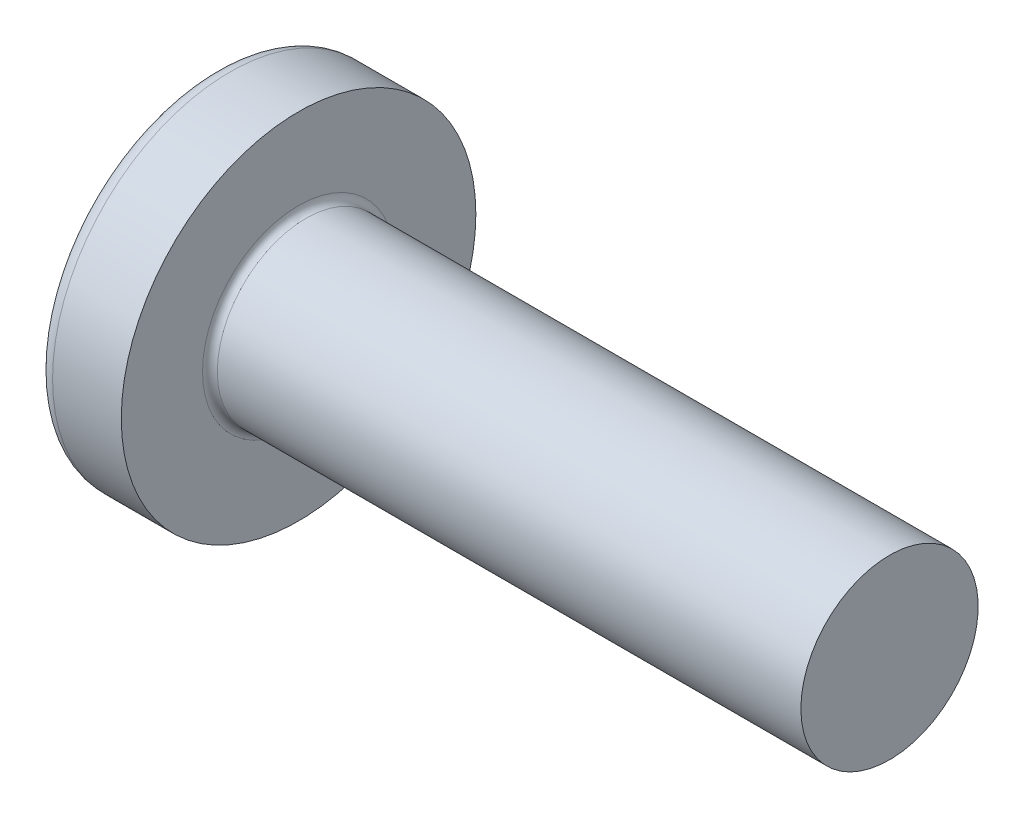
ISO-10303-21;
HEADER;
FILE_DESCRIPTION(('STEP AP214'),'2;1');
FILE_NAME('part.step','',(''),(''),'','','');
FILE_SCHEMA(('AUTOMOTIVE_DESIGN { 1 0 10303 214 1 1 1 1 }'));
ENDSEC;
DATA;
#1=APPLICATION_CONTEXT('core data for automotive mechanical design processes');
#2=APPLICATION_PROTOCOL_DEFINITION('international standard','automotive_design',2000,#1);
#3=PRODUCT_CONTEXT('',#1,'mechanical');
#4=PRODUCT('Part','Part','',(#3));
#5=PRODUCT_RELATED_PRODUCT_CATEGORY('part','',(#4));
#6=PRODUCT_DEFINITION_FORMATION('','',#4);
#7=PRODUCT_DEFINITION_CONTEXT('part definition',#1,'design');
#8=PRODUCT_DEFINITION('design','',#6,#7);
#9=PRODUCT_DEFINITION_SHAPE('','',#8);
#10=(LENGTH_UNIT() NAMED_UNIT(*) SI_UNIT(.MILLI.,.METRE.));
#11=(NAMED_UNIT(*) PLANE_ANGLE_UNIT() SI_UNIT($,.RADIAN.));
#12=(NAMED_UNIT(*) SI_UNIT($,.STERADIAN.) SOLID_ANGLE_UNIT());
#13=UNCERTAINTY_MEASURE_WITH_UNIT(LENGTH_MEASURE(1.E-05),#10,'distance_accuracy_value','');
#14=(GEOMETRIC_REPRESENTATION_CONTEXT(3) GLOBAL_UNCERTAINTY_ASSIGNED_CONTEXT((#13)) GLOBAL_UNIT_ASSIGNED_CONTEXT((#10,
#11,#12)) REPRESENTATION_CONTEXT('',''));
#15=CARTESIAN_POINT('',(0.,0.,0.));
#16=DIRECTION('',(0.,0.,1.));
#17=DIRECTION('',(1.,0.,0.));
#18=AXIS2_PLACEMENT_3D('',#15,#16,#17);
#19=CARTESIAN_POINT('',(10.,0.,0.));
#20=DIRECTION('',(-1.,0.,0.));
#21=DIRECTION('',(0.,1.,0.));
#22=AXIS2_PLACEMENT_3D('',#19,#20,#21);
#23=SPHERICAL_SURFACE('',#22,10.);
#24=CARTESIAN_POINT('',(1.83373872480847,0.,0.));
#25=DIRECTION('',(-1.,0.,0.));
#26=DIRECTION('',(0.,0.,1.));
#27=AXIS2_PLACEMENT_3D('',#24,#25,#26);
#28=CIRCLE('',#27,5.77167019027484);
#29=CARTESIAN_POINT('',(1.83373872480847,0.,5.77167019027484));
#30=VERTEX_POINT('',#29);
#31=EDGE_CURVE('E212',#30,#30,#28,.T.);
#32=ORIENTED_EDGE('',*,*,#31,.T.);
#33=EDGE_LOOP('',(#32));
#34=FACE_BOUND('',#33,.T.);
#35=CARTESIAN_POINT('',(0.11533271177369,0.,0.));
#36=DIRECTION('',(1.,0.,0.));
#37=DIRECTION('',(0.,0.,-1.));
#38=AXIS2_PLACEMENT_3D('',#35,#36,#37);
#39=CIRCLE('',#38,1.51438192047739);
#40=CARTESIAN_POINT('',(0.115332711773695,-0.709999999999995,-1.33762947076864));
#41=VERTEX_POINT('',#40);
#42=CARTESIAN_POINT('',(0.11533271177369,-1.33762947076862,-0.71));
#43=VERTEX_POINT('',#42);
#44=EDGE_CURVE('E338',#41,#43,#39,.F.);
#45=ORIENTED_EDGE('',*,*,#44,.F.);
#46=CARTESIAN_POINT('',(10.,-0.71,0.));
#47=DIRECTION('',(0.,1.,0.));
#48=DIRECTION('',(0.,0.,1.));
#49=AXIS2_PLACEMENT_3D('',#46,#47,#48);
#50=CIRCLE('',#49,9.97476315508293);
#51=CARTESIAN_POINT('',(0.516695966128057,-0.709999999999989,-3.09238493741451));
#52=VERTEX_POINT('',#51);
#53=EDGE_CURVE('E272',#52,#41,#50,.T.);
#54=ORIENTED_EDGE('',*,*,#53,.F.);
#55=CARTESIAN_POINT('',(9.3467899937754,0.,1.3101368059126));
#56=DIRECTION('',(0.446197753347436,0.,-0.894934391398443));
#57=DIRECTION('',(-0.894934391398443,0.,-0.446197753347436));
#58=AXIS2_PLACEMENT_3D('',#55,#56,#57);
#59=CIRCLE('',#58,9.89226254390578);
#60=CARTESIAN_POINT('',(0.516695966128057,0.710000000000011,-3.0923849374145));
#61=VERTEX_POINT('',#60);
#62=EDGE_CURVE('E246',#52,#61,#59,.T.);
#63=ORIENTED_EDGE('',*,*,#62,.T.);
#64=CARTESIAN_POINT('',(10.,0.71,0.));
#65=DIRECTION('',(0.,-1.,0.));
#66=DIRECTION('',(0.,0.,-1.));
#67=AXIS2_PLACEMENT_3D('',#64,#65,#66);
#68=CIRCLE('',#67,9.97476315508293);
#69=CARTESIAN_POINT('',(0.115332711773694,0.710000000000005,-1.33762947076863));
#70=VERTEX_POINT('',#69);
#71=EDGE_CURVE('E300',#70,#61,#68,.T.);
#72=ORIENTED_EDGE('',*,*,#71,.F.);
#73=CARTESIAN_POINT('',(0.11533271177369,1.33762947076862,-0.71));
#74=VERTEX_POINT('',#73);
#75=EDGE_CURVE('E353',#74,#70,#39,.F.);
#76=ORIENTED_EDGE('',*,*,#75,.F.);
#77=CARTESIAN_POINT('',(10.,0.,-0.71));
#78=DIRECTION('',(0.,0.,1.));
#79=DIRECTION('',(1.,0.,0.));
#80=AXIS2_PLACEMENT_3D('',#77,#78,#79);
#81=CIRCLE('',#80,9.97476315508293);
#82=CARTESIAN_POINT('',(0.516695966128057,3.09238493741451,-0.71));
#83=VERTEX_POINT('',#82);
#84=EDGE_CURVE('E240',#83,#74,#81,.T.);
#85=ORIENTED_EDGE('',*,*,#84,.F.);
#86=CARTESIAN_POINT('',(9.3467899937754,-1.3101368059126,0.));
#87=DIRECTION('',(0.446197753347436,0.894934391398443,0.));
#88=DIRECTION('',(-0.894934391398443,0.446197753347436,0.));
#89=AXIS2_PLACEMENT_3D('',#86,#87,#88);
#90=CIRCLE('',#89,9.89226254390578);
#91=CARTESIAN_POINT('',(0.516695966128057,3.09238493741451,0.71));
#92=VERTEX_POINT('',#91);
#93=EDGE_CURVE('E243',#83,#92,#90,.T.);
#94=ORIENTED_EDGE('',*,*,#93,.T.);
#95=CARTESIAN_POINT('',(10.,0.,0.71));
#96=DIRECTION('',(0.,0.,-1.));
#97=DIRECTION('',(0.,1.,0.));
#98=AXIS2_PLACEMENT_3D('',#95,#96,#97);
#99=CIRCLE('',#98,9.97476315508293);
#100=CARTESIAN_POINT('',(0.11533271177369,1.33762947076862,0.71));
#101=VERTEX_POINT('',#100);
#102=EDGE_CURVE('E236',#101,#92,#99,.T.);
#103=ORIENTED_EDGE('',*,*,#102,.F.);
#104=CARTESIAN_POINT('',(0.115332711773695,0.709999999999995,1.33762947076864));
#105=VERTEX_POINT('',#104);
#106=EDGE_CURVE('E352',#105,#101,#39,.F.);
#107=ORIENTED_EDGE('',*,*,#106,.F.);
#108=CARTESIAN_POINT('',(0.516695966128057,0.709999999999989,3.09238493741451));
#109=VERTEX_POINT('',#108);
#110=EDGE_CURVE('E256',#109,#105,#68,.T.);
#111=ORIENTED_EDGE('',*,*,#110,.F.);
#112=CARTESIAN_POINT('',(9.3467899937754,0.,-1.3101368059126));
#113=DIRECTION('',(0.446197753347436,0.,0.894934391398443));
#114=DIRECTION('',(0.894934391398443,0.,-0.446197753347436));
#115=AXIS2_PLACEMENT_3D('',#112,#113,#114);
#116=CIRCLE('',#115,9.89226254390578);
#117=CARTESIAN_POINT('',(0.516695966128057,-0.710000000000011,3.0923849374145));
#118=VERTEX_POINT('',#117);
#119=EDGE_CURVE('E47',#109,#118,#116,.T.);
#120=ORIENTED_EDGE('',*,*,#119,.T.);
#121=CARTESIAN_POINT('',(0.115332711773694,-0.710000000000005,1.33762947076863));
#122=VERTEX_POINT('',#121);
#123=EDGE_CURVE('E253',#122,#118,#50,.T.);
#124=ORIENTED_EDGE('',*,*,#123,.F.);
#125=CARTESIAN_POINT('',(0.11533271177369,-1.33762947076862,0.709999999999999));
#126=VERTEX_POINT('',#125);
#127=EDGE_CURVE('E384',#126,#122,#39,.F.);
#128=ORIENTED_EDGE('',*,*,#127,.F.);
#129=CARTESIAN_POINT('',(0.516695966128057,-3.0923849374145,0.709999999999999));
#130=VERTEX_POINT('',#129);
#131=EDGE_CURVE('E237',#130,#126,#99,.T.);
#132=ORIENTED_EDGE('',*,*,#131,.F.);
#133=CARTESIAN_POINT('',(9.3467899937754,1.3101368059126,0.));
#134=DIRECTION('',(0.446197753347436,-0.894934391398443,0.));
#135=DIRECTION('',(0.894934391398443,0.446197753347436,0.));
#136=AXIS2_PLACEMENT_3D('',#133,#134,#135);
#137=CIRCLE('',#136,9.89226254390578);
#138=CARTESIAN_POINT('',(0.516695966128057,-3.09238493741451,-0.71));
#139=VERTEX_POINT('',#138);
#140=EDGE_CURVE('E233',#130,#139,#137,.T.);
#141=ORIENTED_EDGE('',*,*,#140,.T.);
#142=EDGE_CURVE('E62',#43,#139,#81,.T.);
#143=ORIENTED_EDGE('',*,*,#142,.F.);
#144=EDGE_LOOP('',(#45,#54,#63,#72,#76,#85,#94,#103,#107,#111,#120,#124,#128,#132,#141,#143));
#145=FACE_BOUND('',#144,.T.);
#146=ADVANCED_FACE('F34',(#34,#145),#23,.T.);
#147=CARTESIAN_POINT('',(3.46,1.62490792462486,-0.71));
#148=DIRECTION('',(0.,0.,1.));
#149=DIRECTION('',(1.,0.,0.));
#150=AXIS2_PLACEMENT_3D('',#147,#148,#149);
#151=PLANE('',#150);
#152=ORIENTED_EDGE('',*,*,#84,.T.);
#153=CARTESIAN_POINT('',(-2.28089704213722,1.52473965101837,-0.71));
#154=CARTESIAN_POINT('',(-1.81861622822998,1.48907386498352,-0.71));
#155=CARTESIAN_POINT('',(-1.35635131302274,1.45320000395987,-0.71));
#156=CARTESIAN_POINT('',(-0.431857761667543,1.3808964085712,-0.71));
#157=CARTESIAN_POINT('',(0.0303708738054363,1.34446666558133,-0.71));
#158=CARTESIAN_POINT('',(0.954772750089382,1.27091270389059,-0.71));
#159=CARTESIAN_POINT('',(1.41694599093296,1.23378848560061,-0.71));
#160=CARTESIAN_POINT('',(2.1101468655661,1.17741958304234,-0.71));
#161=CARTESIAN_POINT('',(2.34120225142472,1.15851633138213,-0.71));
#162=CARTESIAN_POINT('',(2.80329254149198,1.12044387603508,-0.71));
#163=CARTESIAN_POINT('',(3.03432744556048,1.10127467065167,-0.71));
#164=CARTESIAN_POINT('',(3.81376951672291,1.03608826026628,-0.71));
#165=CARTESIAN_POINT('',(4.3621185642133,0.989367924506424,-0.71));
#166=CARTESIAN_POINT('',(5.18446393534975,0.917336183170652,-0.71));
#167=CARTESIAN_POINT('',(5.45854573527601,0.893000731200899,-0.71));
#168=CARTESIAN_POINT('',(6.00663594033703,0.843493254998865,-0.71));
#169=CARTESIAN_POINT('',(6.28064434495887,0.818321225066341,-0.71));
#170=CARTESIAN_POINT('',(6.82859287274618,0.766879824151132,-0.71));
#171=CARTESIAN_POINT('',(7.10253298312854,0.740610316661091,-0.71));
#172=CARTESIAN_POINT('',(7.65026285025565,0.686585019837831,-0.71));
#173=CARTESIAN_POINT('',(7.92405260972714,0.658829258423122,-0.71));
#174=CARTESIAN_POINT('',(8.33458184018721,0.615573696383427,-0.71));
#175=CARTESIAN_POINT('',(8.4714065534312,0.600884001267348,-0.71));
#176=CARTESIAN_POINT('',(8.74498055470476,0.570826220799602,-0.71));
#177=CARTESIAN_POINT('',(8.88172984329827,0.555458140591717,-0.71));
#178=CARTESIAN_POINT('',(9.15513948220117,0.523868434617907,-0.71));
#179=CARTESIAN_POINT('',(9.29179982631774,0.507646754763106,-0.71));
#180=CARTESIAN_POINT('',(9.56498051884117,0.474039680066355,-0.71));
#181=CARTESIAN_POINT('',(9.70150086350508,0.45665425489429,-0.71));
#182=CARTESIAN_POINT('',(9.83792645731126,0.438531836217977,-0.71));
#183=B_SPLINE_CURVE_WITH_KNOTS('',3,(#153,#154,#155,#156,#157,#158,#159,#160,#161,#162,#163,
#164,#165,#166,#167,#168,#169,#170,#171,#172,#173,#174,#175,#176,#177,#178,#179,#180,#181,#182),
.UNSPECIFIED.,.F.,.F.,(4,2,2,2,2,2,2,2,2,2,2,2,2,2,4),(0.,1.39096401174475,2.78194962715189,
4.17293441960638,4.86841633218882,5.56390268344286,7.21490482310267,8.04038405799492,
8.86586891866053,9.69145676295231,10.5170291044415,10.9298607906012,11.3426893470464,
11.7555440942062,12.1684096055867),.UNSPECIFIED.);
#184=CARTESIAN_POINT('',(3.46,1.06563607765503,-0.710000000000001));
#185=VERTEX_POINT('',#184);
#186=EDGE_CURVE('E373',#74,#185,#183,.T.);
#187=ORIENTED_EDGE('',*,*,#186,.T.);
#188=DIRECTION('',(0.,1.,0.));
#189=VECTOR('',#188,1.);
#190=CARTESIAN_POINT('',(3.46,-1.62490792462486,-0.71));
#191=LINE('',#190,#189);
#192=CARTESIAN_POINT('',(3.46,1.62490792462486,-0.71));
#193=VERTEX_POINT('',#192);
#194=EDGE_CURVE('E321',#185,#193,#191,.T.);
#195=ORIENTED_EDGE('',*,*,#194,.T.);
#196=DIRECTION('',(0.894934391398442,-0.446197753347436,0.));
#197=VECTOR('',#196,1.);
#198=CARTESIAN_POINT('',(0.,3.35,-0.71));
#199=LINE('',#198,#197);
#200=EDGE_CURVE('E213',#83,#193,#199,.T.);
#201=ORIENTED_EDGE('',*,*,#200,.F.);
#202=EDGE_LOOP('',(#152,#187,#195,#201));
#203=FACE_BOUND('',#202,.T.);
#204=ADVANCED_FACE('F168',(#203),#151,.T.);
#205=CARTESIAN_POINT('',(3.46,-1.62490792462486,-0.71));
#206=VERTEX_POINT('',#205);
#207=CARTESIAN_POINT('',(3.46,-1.06563607765503,-0.710000000000001));
#208=VERTEX_POINT('',#207);
#209=EDGE_CURVE('E221',#206,#208,#191,.T.);
#210=ORIENTED_EDGE('',*,*,#209,.T.);
#211=CARTESIAN_POINT('',(-2.28089704213722,-1.52473965101837,-0.71));
#212=CARTESIAN_POINT('',(-1.81861622822998,-1.48907386498352,-0.71));
#213=CARTESIAN_POINT('',(-1.35635131302274,-1.45320000395987,-0.71));
#214=CARTESIAN_POINT('',(-0.431857761667543,-1.3808964085712,-0.71));
#215=CARTESIAN_POINT('',(0.0303708738054364,-1.34446666558133,-0.71));
#216=CARTESIAN_POINT('',(0.954772750089383,-1.27091270389059,-0.71));
#217=CARTESIAN_POINT('',(1.41694599093296,-1.23378848560061,-0.71));
#218=CARTESIAN_POINT('',(2.1101468655661,-1.17741958304234,-0.71));
#219=CARTESIAN_POINT('',(2.34120225142472,-1.15851633138213,-0.71));
#220=CARTESIAN_POINT('',(2.80329254149198,-1.12044387603508,-0.71));
#221=CARTESIAN_POINT('',(3.03432744556048,-1.10127467065167,-0.71));
#222=CARTESIAN_POINT('',(3.81376951672291,-1.03608826026628,-0.71));
#223=CARTESIAN_POINT('',(4.3621185642133,-0.989367924506424,-0.71));
#224=CARTESIAN_POINT('',(5.18446393534975,-0.917336183170652,-0.71));
#225=CARTESIAN_POINT('',(5.45854573527601,-0.893000731200899,-0.71));
#226=CARTESIAN_POINT('',(6.00663594033703,-0.843493254998865,-0.71));
#227=CARTESIAN_POINT('',(6.28064434495887,-0.818321225066341,-0.71));
#228=CARTESIAN_POINT('',(6.82859287274618,-0.766879824151132,-0.71));
#229=CARTESIAN_POINT('',(7.10253298312854,-0.740610316661091,-0.71));
#230=CARTESIAN_POINT('',(7.65026285025565,-0.686585019837831,-0.71));
#231=CARTESIAN_POINT('',(7.92405260972714,-0.658829258423122,-0.71));
#232=CARTESIAN_POINT('',(8.33458184018721,-0.615573696383427,-0.71));
#233=CARTESIAN_POINT('',(8.4714065534312,-0.600884001267348,-0.71));
#234=CARTESIAN_POINT('',(8.74498055470476,-0.570826220799602,-0.71));
#235=CARTESIAN_POINT('',(8.88172984329826,-0.555458140591717,-0.71));
#236=CARTESIAN_POINT('',(9.15513948220117,-0.523868434617907,-0.71));
#237=CARTESIAN_POINT('',(9.29179982631774,-0.507646754763106,-0.71));
#238=CARTESIAN_POINT('',(9.56498051884117,-0.474039680066355,-0.71));
#239=CARTESIAN_POINT('',(9.70150086350508,-0.456654254894289,-0.71));
#240=CARTESIAN_POINT('',(9.83792645731126,-0.438531836217976,-0.71));
#241=B_SPLINE_CURVE_WITH_KNOTS('',3,(#211,#212,#213,#214,#215,#216,#217,#218,#219,#220,#221,
#222,#223,#224,#225,#226,#227,#228,#229,#230,#231,#232,#233,#234,#235,#236,#237,#238,#239,#240),
.UNSPECIFIED.,.F.,.F.,(4,2,2,2,2,2,2,2,2,2,2,2,2,2,4),(0.,1.39096401174475,2.78194962715189,
4.17293441960638,4.86841633218882,5.56390268344286,7.21490482310267,8.04038405799492,
8.86586891866053,9.69145676295231,10.5170291044415,10.9298607906012,11.3426893470464,
11.7555440942062,12.1684096055867),.UNSPECIFIED.);
#242=EDGE_CURVE('E351',#208,#43,#241,.F.);
#243=ORIENTED_EDGE('',*,*,#242,.T.);
#244=ORIENTED_EDGE('',*,*,#142,.T.);
#245=DIRECTION('',(0.894934391398442,0.446197753347436,0.));
#246=VECTOR('',#245,1.);
#247=CARTESIAN_POINT('',(0.,-3.35,-0.71));
#248=LINE('',#247,#246);
#249=EDGE_CURVE('E303',#139,#206,#248,.T.);
#250=ORIENTED_EDGE('',*,*,#249,.T.);
#251=EDGE_LOOP('',(#210,#243,#244,#250));
#252=FACE_BOUND('',#251,.T.);
#253=ADVANCED_FACE('F174',(#252),#151,.T.);
#254=CARTESIAN_POINT('',(3.46,-1.62490792462486,0.71));
#255=DIRECTION('',(0.,0.,-1.));
#256=DIRECTION('',(0.,1.,0.));
#257=AXIS2_PLACEMENT_3D('',#254,#255,#256);
#258=PLANE('',#257);
#259=DIRECTION('',(0.,-1.,0.));
#260=VECTOR('',#259,1.);
#261=CARTESIAN_POINT('',(3.46,1.62490792462486,0.71));
#262=LINE('',#261,#260);
#263=CARTESIAN_POINT('',(3.46,1.62490792462486,0.71));
#264=VERTEX_POINT('',#263);
#265=CARTESIAN_POINT('',(3.46,1.06563607765503,0.710000000000001));
#266=VERTEX_POINT('',#265);
#267=EDGE_CURVE('E311',#264,#266,#262,.T.);
#268=ORIENTED_EDGE('',*,*,#267,.T.);
#269=CARTESIAN_POINT('',(-2.28089705027091,1.52473965164577,0.71));
#270=CARTESIAN_POINT('',(-1.81861623532717,1.48907386553353,0.71));
#271=CARTESIAN_POINT('',(-1.35635131908348,1.45320000443187,0.71));
#272=CARTESIAN_POINT('',(-0.431857765655442,1.38089640888514,0.71));
#273=CARTESIAN_POINT('',(0.0303708708539246,1.3444666658152,0.71));
#274=CARTESIAN_POINT('',(0.954772749881989,1.27091270390807,0.71));
#275=CARTESIAN_POINT('',(1.41694599243322,1.23378848548075,0.71));
#276=CARTESIAN_POINT('',(2.11014686962733,1.17741958271103,0.71));
#277=CARTESIAN_POINT('',(2.3412022563395,1.15851633097942,0.71));
#278=CARTESIAN_POINT('',(2.80329254811369,1.12044387548729,0.71));
#279=CARTESIAN_POINT('',(3.03432745303557,1.10127467003019,0.71));
#280=CARTESIAN_POINT('',(3.8137695250509,1.03608825956087,0.71));
#281=CARTESIAN_POINT('',(4.36211857254078,0.989367923790553,0.71));
#282=CARTESIAN_POINT('',(5.18446394367596,0.917336182434635,0.71));
#283=CARTESIAN_POINT('',(5.45854574360168,0.893000730457427,0.71));
#284=CARTESIAN_POINT('',(6.00663594866142,0.843493254238334,0.71));
#285=CARTESIAN_POINT('',(6.28064435328252,0.818321224296205,0.71));
#286=CARTESIAN_POINT('',(6.82859288106827,0.766879823358567,0.71));
#287=CARTESIAN_POINT('',(7.1025329914498,0.7406103158557,0.71));
#288=CARTESIAN_POINT('',(7.65026285857465,0.686585019001786,0.71));
#289=CARTESIAN_POINT('',(7.92405261804469,0.658829257569248,0.71));
#290=CARTESIAN_POINT('',(8.3345818485019,0.61557369549618,0.71));
#291=CARTESIAN_POINT('',(8.47140656174489,0.600884000367865,0.71));
#292=CARTESIAN_POINT('',(8.74498056301602,0.570826219872502,0.71));
#293=CARTESIAN_POINT('',(8.8817298516081,0.555458139649238,0.71));
#294=CARTESIAN_POINT('',(9.15513949050765,0.523868433640255,0.71));
#295=CARTESIAN_POINT('',(9.29179983462227,0.50764675376566,0.71));
#296=CARTESIAN_POINT('',(9.56498052714077,0.474039679022048,0.71));
#297=CARTESIAN_POINT('',(9.70150087180168,0.456654253822914,0.71));
#298=CARTESIAN_POINT('',(9.83792646560407,0.438531835114465,0.71));
#299=B_SPLINE_CURVE_WITH_KNOTS('',3,(#269,#270,#271,#272,#273,#274,#275,#276,#277,#278,#279,
#280,#281,#282,#283,#284,#285,#286,#287,#288,#289,#290,#291,#292,#293,#294,#295,#296,#297,#298),
.UNSPECIFIED.,.F.,.F.,(4,2,2,2,2,2,2,2,2,2,2,2,2,2,4),(0.,1.39096401486289,2.78194963338846,
4.17293443098243,4.86841634613445,5.56390269995814,7.21490483961907,8.04038407451168,
8.86586893517771,9.69145677947068,10.5170291209609,10.9298608071215,11.3426893635676,
11.7555441107285,12.1684096221104),.UNSPECIFIED.);
#300=EDGE_CURVE('E277',#266,#101,#299,.F.);
#301=ORIENTED_EDGE('',*,*,#300,.T.);
#302=ORIENTED_EDGE('',*,*,#102,.T.);
#303=DIRECTION('',(0.894934391398442,-0.446197753347436,0.));
#304=VECTOR('',#303,1.);
#305=CARTESIAN_POINT('',(0.,3.35,0.71));
#306=LINE('',#305,#304);
#307=EDGE_CURVE('E218',#92,#264,#306,.T.);
#308=ORIENTED_EDGE('',*,*,#307,.T.);
#309=EDGE_LOOP('',(#268,#301,#302,#308));
#310=FACE_BOUND('',#309,.T.);
#311=ADVANCED_FACE('F369',(#310),#258,.T.);
#312=ORIENTED_EDGE('',*,*,#131,.T.);
#313=CARTESIAN_POINT('',(-2.28089704213722,-1.52473965101837,0.71));
#314=CARTESIAN_POINT('',(-1.81861622822998,-1.48907386498352,0.71));
#315=CARTESIAN_POINT('',(-1.35635131302274,-1.45320000395987,0.71));
#316=CARTESIAN_POINT('',(-0.431857761667543,-1.3808964085712,0.71));
#317=CARTESIAN_POINT('',(0.0303708738054362,-1.34446666558133,0.71));
#318=CARTESIAN_POINT('',(0.954772750089382,-1.27091270389059,0.71));
#319=CARTESIAN_POINT('',(1.41694599093296,-1.23378848560061,0.71));
#320=CARTESIAN_POINT('',(2.1101468655661,-1.17741958304234,0.71));
#321=CARTESIAN_POINT('',(2.34120225142472,-1.15851633138213,0.71));
#322=CARTESIAN_POINT('',(2.80329254149198,-1.12044387603508,0.71));
#323=CARTESIAN_POINT('',(3.03432744556048,-1.10127467065167,0.71));
#324=CARTESIAN_POINT('',(3.81376951672291,-1.03608826026628,0.71));
#325=CARTESIAN_POINT('',(4.3621185642133,-0.989367924506424,0.71));
#326=CARTESIAN_POINT('',(5.18446393534975,-0.917336183170652,0.71));
#327=CARTESIAN_POINT('',(5.45854573527601,-0.893000731200899,0.71));
#328=CARTESIAN_POINT('',(6.00663594033703,-0.843493254998865,0.71));
#329=CARTESIAN_POINT('',(6.28064434495887,-0.818321225066341,0.71));
#330=CARTESIAN_POINT('',(6.82859287274618,-0.766879824151132,0.71));
#331=CARTESIAN_POINT('',(7.10253298312854,-0.740610316661091,0.71));
#332=CARTESIAN_POINT('',(7.65026285025566,-0.686585019837831,0.71));
#333=CARTESIAN_POINT('',(7.92405260972714,-0.658829258423122,0.71));
#334=CARTESIAN_POINT('',(8.33458184018721,-0.615573696383427,0.71));
#335=CARTESIAN_POINT('',(8.4714065534312,-0.600884001267348,0.71));
#336=CARTESIAN_POINT('',(8.74498055470476,-0.570826220799602,0.71));
#337=CARTESIAN_POINT('',(8.88172984329826,-0.555458140591717,0.71));
#338=CARTESIAN_POINT('',(9.15513948220117,-0.523868434617907,0.71));
#339=CARTESIAN_POINT('',(9.29179982631774,-0.507646754763106,0.71));
#340=CARTESIAN_POINT('',(9.56498051884117,-0.474039680066355,0.71));
#341=CARTESIAN_POINT('',(9.70150086350508,-0.456654254894289,0.71));
#342=CARTESIAN_POINT('',(9.83792645731126,-0.438531836217976,0.71));
#343=B_SPLINE_CURVE_WITH_KNOTS('',3,(#313,#314,#315,#316,#317,#318,#319,#320,#321,#322,#323,
#324,#325,#326,#327,#328,#329,#330,#331,#332,#333,#334,#335,#336,#337,#338,#339,#340,#341,#342),
.UNSPECIFIED.,.F.,.F.,(4,2,2,2,2,2,2,2,2,2,2,2,2,2,4),(0.,1.39096401174475,2.78194962715189,
4.17293441960638,4.86841633218882,5.56390268344286,7.21490482310267,8.04038405799493,
8.86586891866053,9.69145676295231,10.5170291044415,10.9298607906012,11.3426893470464,
11.7555440942062,12.1684096055867),.UNSPECIFIED.);
#344=CARTESIAN_POINT('',(3.46,-1.06563607765503,0.710000000000001));
#345=VERTEX_POINT('',#344);
#346=EDGE_CURVE('E385',#126,#345,#343,.T.);
#347=ORIENTED_EDGE('',*,*,#346,.T.);
#348=CARTESIAN_POINT('',(3.46,-1.62490792462486,0.71));
#349=VERTEX_POINT('',#348);
#350=EDGE_CURVE('E313',#345,#349,#262,.T.);
#351=ORIENTED_EDGE('',*,*,#350,.T.);
#352=DIRECTION('',(0.894934391398442,0.446197753347436,0.));
#353=VECTOR('',#352,1.);
#354=CARTESIAN_POINT('',(0.,-3.35,0.709999999999999));
#355=LINE('',#354,#353);
#356=EDGE_CURVE('E305',#130,#349,#355,.T.);
#357=ORIENTED_EDGE('',*,*,#356,.F.);
#358=EDGE_LOOP('',(#312,#347,#351,#357));
#359=FACE_BOUND('',#358,.T.);
#360=ADVANCED_FACE('F414',(#359),#258,.T.);
#361=CARTESIAN_POINT('',(3.46,1.62490792462486,-0.709999999999999));
#362=DIRECTION('',(-1.,0.,0.));
#363=DIRECTION('',(0.,0.,1.));
#364=AXIS2_PLACEMENT_3D('',#361,#362,#363);
#365=PLANE('',#364);
#366=ORIENTED_EDGE('',*,*,#350,.F.);
#367=CARTESIAN_POINT('',(3.46,0.,0.));
#368=DIRECTION('',(-1.,0.,0.));
#369=DIRECTION('',(0.,0.,1.));
#370=AXIS2_PLACEMENT_3D('',#367,#368,#369);
#371=CIRCLE('',#370,1.2805);
#372=EDGE_CURVE('E346',#208,#345,#371,.T.);
#373=ORIENTED_EDGE('',*,*,#372,.F.);
#374=ORIENTED_EDGE('',*,*,#209,.F.);
#375=DIRECTION('',(0.,0.,1.));
#376=VECTOR('',#375,1.);
#377=CARTESIAN_POINT('',(3.46,-1.62490792462486,-0.71));
#378=LINE('',#377,#376);
#379=EDGE_CURVE('E308',#206,#349,#378,.T.);
#380=ORIENTED_EDGE('',*,*,#379,.T.);
#381=EDGE_LOOP('',(#366,#373,#374,#380));
#382=FACE_BOUND('',#381,.T.);
#383=ADVANCED_FACE('F407',(#382),#365,.T.);
#384=DIRECTION('',(0.,0.,-1.));
#385=VECTOR('',#384,1.);
#386=CARTESIAN_POINT('',(3.46,-0.710000000000006,1.62490792462486));
#387=LINE('',#386,#385);
#388=CARTESIAN_POINT('',(3.46,-0.709999999999996,-1.06563607765503));
#389=VERTEX_POINT('',#388);
#390=CARTESIAN_POINT('',(3.46,-0.709999999999994,-1.62490792462486));
#391=VERTEX_POINT('',#390);
#392=EDGE_CURVE('E294',#389,#391,#387,.T.);
#393=ORIENTED_EDGE('',*,*,#392,.F.);
#394=CARTESIAN_POINT('',(3.46,0.710000000000004,-1.06563607765503));
#395=VERTEX_POINT('',#394);
#396=EDGE_CURVE('E54',#395,#389,#371,.T.);
#397=ORIENTED_EDGE('',*,*,#396,.F.);
#398=DIRECTION('',(0.,0.,1.));
#399=VECTOR('',#398,1.);
#400=CARTESIAN_POINT('',(3.46,0.710000000000006,-1.62490792462486));
#401=LINE('',#400,#399);
#402=CARTESIAN_POINT('',(3.46,0.710000000000006,-1.62490792462486));
#403=VERTEX_POINT('',#402);
#404=EDGE_CURVE('E297',#403,#395,#401,.T.);
#405=ORIENTED_EDGE('',*,*,#404,.F.);
#406=DIRECTION('',(0.,-1.,0.));
#407=VECTOR('',#406,1.);
#408=CARTESIAN_POINT('',(3.46,0.710000000000006,-1.62490792462486));
#409=LINE('',#408,#407);
#410=EDGE_CURVE('E288',#403,#391,#409,.T.);
#411=ORIENTED_EDGE('',*,*,#410,.T.);
#412=EDGE_LOOP('',(#393,#397,#405,#411));
#413=FACE_BOUND('',#412,.T.);
#414=ADVANCED_FACE('F341',(#413),#365,.T.);
#415=ORIENTED_EDGE('',*,*,#194,.F.);
#416=EDGE_CURVE('E345',#266,#185,#371,.T.);
#417=ORIENTED_EDGE('',*,*,#416,.F.);
#418=ORIENTED_EDGE('',*,*,#267,.F.);
#419=DIRECTION('',(0.,0.,-1.));
#420=VECTOR('',#419,1.);
#421=CARTESIAN_POINT('',(3.46,1.62490792462486,0.71));
#422=LINE('',#421,#420);
#423=EDGE_CURVE('E314',#264,#193,#422,.T.);
#424=ORIENTED_EDGE('',*,*,#423,.T.);
#425=EDGE_LOOP('',(#415,#417,#418,#424));
#426=FACE_BOUND('',#425,.T.);
#427=ADVANCED_FACE('F408',(#426),#365,.T.);
#428=CARTESIAN_POINT('',(3.46,0.709999999999994,1.62490792462486));
#429=DIRECTION('',(0.,-1.,0.));
#430=DIRECTION('',(1.,0.,0.));
#431=AXIS2_PLACEMENT_3D('',#428,#429,#430);
#432=PLANE('',#431);
#433=ORIENTED_EDGE('',*,*,#110,.T.);
#434=CARTESIAN_POINT('',(-2.28089704213722,0.709999999999995,1.52473965101837));
#435=CARTESIAN_POINT('',(-1.81861622822998,0.709999999999995,1.48907386498352));
#436=CARTESIAN_POINT('',(-1.35635131302274,0.709999999999995,1.45320000395987));
#437=CARTESIAN_POINT('',(-0.431857761667543,0.709999999999995,1.38089640857121));
#438=CARTESIAN_POINT('',(0.0303708738054362,0.709999999999995,1.34446666558134));
#439=CARTESIAN_POINT('',(0.954772750089383,0.709999999999995,1.2709127038906));
#440=CARTESIAN_POINT('',(1.41694599093296,0.709999999999996,1.23378848560061));
#441=CARTESIAN_POINT('',(2.1101468655661,0.709999999999996,1.17741958304234));
#442=CARTESIAN_POINT('',(2.34120225142472,0.709999999999996,1.15851633138213));
#443=CARTESIAN_POINT('',(2.80329254149198,0.709999999999996,1.12044387603508));
#444=CARTESIAN_POINT('',(3.03432744556048,0.709999999999996,1.10127467065167));
#445=CARTESIAN_POINT('',(3.81376951672291,0.709999999999996,1.03608826026628));
#446=CARTESIAN_POINT('',(4.3621185642133,0.709999999999997,0.989367924506427));
#447=CARTESIAN_POINT('',(5.18446393534975,0.709999999999997,0.917336183170655));
#448=CARTESIAN_POINT('',(5.45854573527601,0.709999999999997,0.893000731200901));
#449=CARTESIAN_POINT('',(6.00663594033703,0.709999999999997,0.843493254998868));
#450=CARTESIAN_POINT('',(6.28064434495887,0.709999999999997,0.818321225066344));
#451=CARTESIAN_POINT('',(6.82859287274618,0.709999999999997,0.766879824151135));
#452=CARTESIAN_POINT('',(7.10253298312854,0.709999999999997,0.740610316661093));
#453=CARTESIAN_POINT('',(7.65026285025565,0.709999999999998,0.686585019837834));
#454=CARTESIAN_POINT('',(7.92405260972714,0.709999999999998,0.658829258423125));
#455=CARTESIAN_POINT('',(8.33458184018721,0.709999999999998,0.615573696383429));
#456=CARTESIAN_POINT('',(8.4714065534312,0.709999999999998,0.600884001267351));
#457=CARTESIAN_POINT('',(8.74498055470475,0.709999999999998,0.570826220799605));
#458=CARTESIAN_POINT('',(8.88172984329826,0.709999999999998,0.55545814059172));
#459=CARTESIAN_POINT('',(9.15513948220117,0.709999999999998,0.52386843461791));
#460=CARTESIAN_POINT('',(9.29179982631774,0.709999999999998,0.507646754763109));
#461=CARTESIAN_POINT('',(9.56498051884117,0.709999999999998,0.474039680066358));
#462=CARTESIAN_POINT('',(9.70150086350508,0.709999999999998,0.456654254894292));
#463=CARTESIAN_POINT('',(9.83792645731126,0.709999999999998,0.438531836217979));
#464=B_SPLINE_CURVE_WITH_KNOTS('',3,(#434,#435,#436,#437,#438,#439,#440,#441,#442,#443,#444,
#445,#446,#447,#448,#449,#450,#451,#452,#453,#454,#455,#456,#457,#458,#459,#460,#461,#462,#463),
.UNSPECIFIED.,.F.,.F.,(4,2,2,2,2,2,2,2,2,2,2,2,2,2,4),(0.,1.39096401174475,2.78194962715189,
4.17293441960638,4.86841633218882,5.56390268344286,7.21490482310267,8.04038405799492,
8.86586891866053,9.6914567629523,10.5170291044415,10.9298607906012,11.3426893470464,
11.7555440942062,12.1684096055867),.UNSPECIFIED.);
#465=CARTESIAN_POINT('',(3.46,0.709999999999996,1.06563607765503));
#466=VERTEX_POINT('',#465);
#467=EDGE_CURVE('E432',#105,#466,#464,.T.);
#468=ORIENTED_EDGE('',*,*,#467,.T.);
#469=CARTESIAN_POINT('',(3.46,0.709999999999994,1.62490792462486));
#470=VERTEX_POINT('',#469);
#471=EDGE_CURVE('E270',#466,#470,#401,.T.);
#472=ORIENTED_EDGE('',*,*,#471,.T.);
#473=DIRECTION('',(0.894934391398442,0.,-0.446197753347436));
#474=VECTOR('',#473,1.);
#475=CARTESIAN_POINT('',(0.,0.709999999999988,3.35));
#476=LINE('',#475,#474);
#477=EDGE_CURVE('E263',#109,#470,#476,.T.);
#478=ORIENTED_EDGE('',*,*,#477,.F.);
#479=EDGE_LOOP('',(#433,#468,#472,#478));
#480=FACE_BOUND('',#479,.T.);
#481=ADVANCED_FACE('F267',(#480),#432,.T.);
#482=CARTESIAN_POINT('',(3.46,-0.709999999999994,-1.62490792462486));
#483=DIRECTION('',(0.,1.,0.));
#484=DIRECTION('',(0.,0.,1.));
#485=AXIS2_PLACEMENT_3D('',#482,#483,#484);
#486=PLANE('',#485);
#487=CARTESIAN_POINT('',(3.46,-0.710000000000006,1.62490792462486));
#488=VERTEX_POINT('',#487);
#489=CARTESIAN_POINT('',(3.46,-0.710000000000004,1.06563607765503));
#490=VERTEX_POINT('',#489);
#491=EDGE_CURVE('E291',#488,#490,#387,.T.);
#492=ORIENTED_EDGE('',*,*,#491,.T.);
#493=CARTESIAN_POINT('',(-2.28089705027091,-0.710000000000005,1.52473965164577));
#494=CARTESIAN_POINT('',(-1.81861623532717,-0.710000000000005,1.48907386553353));
#495=CARTESIAN_POINT('',(-1.35635131908348,-0.710000000000005,1.45320000443187));
#496=CARTESIAN_POINT('',(-0.431857765655443,-0.710000000000005,1.38089640888513));
#497=CARTESIAN_POINT('',(0.030370870853924,-0.710000000000005,1.3444666658152));
#498=CARTESIAN_POINT('',(0.954772749881989,-0.710000000000004,1.27091270390807));
#499=CARTESIAN_POINT('',(1.41694599243322,-0.710000000000004,1.23378848548075));
#500=CARTESIAN_POINT('',(2.11014686962733,-0.710000000000004,1.17741958271102));
#501=CARTESIAN_POINT('',(2.3412022563395,-0.710000000000004,1.15851633097942));
#502=CARTESIAN_POINT('',(2.80329254811369,-0.710000000000004,1.12044387548729));
#503=CARTESIAN_POINT('',(3.03432745303557,-0.710000000000004,1.10127467003019));
#504=CARTESIAN_POINT('',(3.81376952505089,-0.710000000000004,1.03608825956087));
#505=CARTESIAN_POINT('',(4.36211857254078,-0.710000000000004,0.989367923790551));
#506=CARTESIAN_POINT('',(5.18446394367596,-0.710000000000003,0.917336182434633));
#507=CARTESIAN_POINT('',(5.45854574360167,-0.710000000000003,0.893000730457425));
#508=CARTESIAN_POINT('',(6.00663594866141,-0.710000000000003,0.843493254238332));
#509=CARTESIAN_POINT('',(6.28064435328251,-0.710000000000003,0.818321224296203));
#510=CARTESIAN_POINT('',(6.82859288106826,-0.710000000000003,0.766879823358565));
#511=CARTESIAN_POINT('',(7.1025329914498,-0.710000000000003,0.740610315855698));
#512=CARTESIAN_POINT('',(7.65026285857464,-0.710000000000003,0.686585019001784));
#513=CARTESIAN_POINT('',(7.92405261804469,-0.710000000000003,0.658829257569246));
#514=CARTESIAN_POINT('',(8.33458184850189,-0.710000000000002,0.615573695496179));
#515=CARTESIAN_POINT('',(8.47140656174489,-0.710000000000002,0.600884000367863));
#516=CARTESIAN_POINT('',(8.74498056301602,-0.710000000000002,0.5708262198725));
#517=CARTESIAN_POINT('',(8.8817298516081,-0.710000000000002,0.555458139649236));
#518=CARTESIAN_POINT('',(9.15513949050764,-0.710000000000002,0.523868433640253));
#519=CARTESIAN_POINT('',(9.29179983462226,-0.710000000000002,0.507646753765658));
#520=CARTESIAN_POINT('',(9.56498052714076,-0.710000000000002,0.474039679022046));
#521=CARTESIAN_POINT('',(9.70150087180168,-0.710000000000002,0.456654253822912));
#522=CARTESIAN_POINT('',(9.83792646560407,-0.710000000000002,0.438531835114463));
#523=B_SPLINE_CURVE_WITH_KNOTS('',3,(#493,#494,#495,#496,#497,#498,#499,#500,#501,#502,#503,
#504,#505,#506,#507,#508,#509,#510,#511,#512,#513,#514,#515,#516,#517,#518,#519,#520,#521,#522),
.UNSPECIFIED.,.F.,.F.,(4,2,2,2,2,2,2,2,2,2,2,2,2,2,4),(0.,1.39096401486289,2.78194963338846,
4.17293443098243,4.86841634613445,5.56390269995814,7.21490483961907,8.04038407451168,
8.8658689351777,9.69145677947067,10.5170291209609,10.9298608071215,11.3426893635676,
11.7555441107285,12.1684096221104),.UNSPECIFIED.);
#524=EDGE_CURVE('E378',#490,#122,#523,.F.);
#525=ORIENTED_EDGE('',*,*,#524,.T.);
#526=ORIENTED_EDGE('',*,*,#123,.T.);
#527=DIRECTION('',(0.894934391398442,0.,-0.446197753347436));
#528=VECTOR('',#527,1.);
#529=CARTESIAN_POINT('',(0.,-0.710000000000012,3.35));
#530=LINE('',#529,#528);
#531=EDGE_CURVE('E265',#118,#488,#530,.T.);
#532=ORIENTED_EDGE('',*,*,#531,.T.);
#533=EDGE_LOOP('',(#492,#525,#526,#532));
#534=FACE_BOUND('',#533,.T.);
#535=ADVANCED_FACE('F203',(#534),#486,.T.);
#536=ORIENTED_EDGE('',*,*,#404,.T.);
#537=CARTESIAN_POINT('',(-2.28089704213722,0.710000000000005,-1.52473965101837));
#538=CARTESIAN_POINT('',(-1.81861622822998,0.710000000000005,-1.48907386498351));
#539=CARTESIAN_POINT('',(-1.35635131302274,0.710000000000005,-1.45320000395987));
#540=CARTESIAN_POINT('',(-0.431857761667543,0.710000000000005,-1.3808964085712));
#541=CARTESIAN_POINT('',(0.0303708738054363,0.710000000000005,-1.34446666558133));
#542=CARTESIAN_POINT('',(0.954772750089382,0.710000000000004,-1.27091270389059));
#543=CARTESIAN_POINT('',(1.41694599093296,0.710000000000004,-1.23378848560061));
#544=CARTESIAN_POINT('',(2.1101468655661,0.710000000000004,-1.17741958304234));
#545=CARTESIAN_POINT('',(2.34120225142472,0.710000000000004,-1.15851633138212));
#546=CARTESIAN_POINT('',(2.80329254149198,0.710000000000004,-1.12044387603508));
#547=CARTESIAN_POINT('',(3.03432744556048,0.710000000000004,-1.10127467065166));
#548=CARTESIAN_POINT('',(3.81376951672291,0.710000000000004,-1.03608826026627));
#549=CARTESIAN_POINT('',(4.3621185642133,0.710000000000004,-0.989367924506422));
#550=CARTESIAN_POINT('',(5.18446393534975,0.710000000000003,-0.91733618317065));
#551=CARTESIAN_POINT('',(5.45854573527601,0.710000000000003,-0.893000731200896));
#552=CARTESIAN_POINT('',(6.00663594033703,0.710000000000003,-0.843493254998863));
#553=CARTESIAN_POINT('',(6.28064434495887,0.710000000000003,-0.818321225066339));
#554=CARTESIAN_POINT('',(6.82859287274618,0.710000000000003,-0.76687982415113));
#555=CARTESIAN_POINT('',(7.10253298312854,0.710000000000003,-0.740610316661088));
#556=CARTESIAN_POINT('',(7.65026285025565,0.710000000000002,-0.686585019837829));
#557=CARTESIAN_POINT('',(7.92405260972714,0.710000000000002,-0.65882925842312));
#558=CARTESIAN_POINT('',(8.33458184018721,0.710000000000002,-0.615573696383424));
#559=CARTESIAN_POINT('',(8.4714065534312,0.710000000000002,-0.600884001267345));
#560=CARTESIAN_POINT('',(8.74498055470476,0.710000000000002,-0.5708262207996));
#561=CARTESIAN_POINT('',(8.88172984329827,0.710000000000002,-0.555458140591715));
#562=CARTESIAN_POINT('',(9.15513948220117,0.710000000000002,-0.523868434617905));
#563=CARTESIAN_POINT('',(9.29179982631774,0.710000000000002,-0.507646754763103));
#564=CARTESIAN_POINT('',(9.56498051884117,0.710000000000002,-0.474039680066353));
#565=CARTESIAN_POINT('',(9.70150086350508,0.710000000000001,-0.456654254894287));
#566=CARTESIAN_POINT('',(9.83792645731126,0.710000000000001,-0.438531836217974));
#567=B_SPLINE_CURVE_WITH_KNOTS('',3,(#537,#538,#539,#540,#541,#542,#543,#544,#545,#546,#547,
#548,#549,#550,#551,#552,#553,#554,#555,#556,#557,#558,#559,#560,#561,#562,#563,#564,#565,#566),
.UNSPECIFIED.,.F.,.F.,(4,2,2,2,2,2,2,2,2,2,2,2,2,2,4),(0.,1.39096401174475,2.78194962715189,
4.17293441960638,4.86841633218882,5.56390268344286,7.21490482310267,8.04038405799492,
8.86586891866053,9.69145676295231,10.5170291044415,10.9298607906012,11.3426893470464,
11.7555440942062,12.1684096055867),.UNSPECIFIED.);
#568=EDGE_CURVE('E330',#395,#70,#567,.F.);
#569=ORIENTED_EDGE('',*,*,#568,.T.);
#570=ORIENTED_EDGE('',*,*,#71,.T.);
#571=DIRECTION('',(0.894934391398442,0.,0.446197753347436));
#572=VECTOR('',#571,1.);
#573=CARTESIAN_POINT('',(0.,0.710000000000012,-3.35));
#574=LINE('',#573,#572);
#575=EDGE_CURVE('E274',#61,#403,#574,.T.);
#576=ORIENTED_EDGE('',*,*,#575,.T.);
#577=EDGE_LOOP('',(#536,#569,#570,#576));
#578=FACE_BOUND('',#577,.T.);
#579=ADVANCED_FACE('F201',(#578),#432,.T.);
#580=ORIENTED_EDGE('',*,*,#53,.T.);
#581=CARTESIAN_POINT('',(-2.28089704213722,-0.709999999999994,-1.52473965101837));
#582=CARTESIAN_POINT('',(-1.81861622822998,-0.709999999999994,-1.48907386498352));
#583=CARTESIAN_POINT('',(-1.35635131302274,-0.709999999999995,-1.45320000395987));
#584=CARTESIAN_POINT('',(-0.431857761667543,-0.709999999999995,-1.38089640857121));
#585=CARTESIAN_POINT('',(0.0303708738054366,-0.709999999999995,-1.34446666558134));
#586=CARTESIAN_POINT('',(0.954772750089383,-0.709999999999995,-1.2709127038906));
#587=CARTESIAN_POINT('',(1.41694599093296,-0.709999999999995,-1.23378848560061));
#588=CARTESIAN_POINT('',(2.1101468655661,-0.709999999999996,-1.17741958304234));
#589=CARTESIAN_POINT('',(2.34120225142472,-0.709999999999996,-1.15851633138213));
#590=CARTESIAN_POINT('',(2.80329254149198,-0.709999999999996,-1.12044387603508));
#591=CARTESIAN_POINT('',(3.03432744556048,-0.709999999999996,-1.10127467065167));
#592=CARTESIAN_POINT('',(3.81376951672291,-0.709999999999996,-1.03608826026628));
#593=CARTESIAN_POINT('',(4.3621185642133,-0.709999999999996,-0.989367924506427));
#594=CARTESIAN_POINT('',(5.18446393534975,-0.709999999999997,-0.917336183170655));
#595=CARTESIAN_POINT('',(5.458545735276,-0.709999999999997,-0.893000731200901));
#596=CARTESIAN_POINT('',(6.00663594033703,-0.709999999999997,-0.843493254998868));
#597=CARTESIAN_POINT('',(6.28064434495887,-0.709999999999997,-0.818321225066344));
#598=CARTESIAN_POINT('',(6.82859287274618,-0.709999999999997,-0.766879824151135));
#599=CARTESIAN_POINT('',(7.10253298312854,-0.709999999999997,-0.740610316661094));
#600=CARTESIAN_POINT('',(7.65026285025565,-0.709999999999998,-0.686585019837834));
#601=CARTESIAN_POINT('',(7.92405260972714,-0.709999999999998,-0.658829258423125));
#602=CARTESIAN_POINT('',(8.33458184018721,-0.709999999999998,-0.615573696383429));
#603=CARTESIAN_POINT('',(8.4714065534312,-0.709999999999998,-0.60088400126735));
#604=CARTESIAN_POINT('',(8.74498055470476,-0.709999999999998,-0.570826220799605));
#605=CARTESIAN_POINT('',(8.88172984329826,-0.709999999999998,-0.55545814059172));
#606=CARTESIAN_POINT('',(9.15513948220117,-0.709999999999998,-0.52386843461791));
#607=CARTESIAN_POINT('',(9.29179982631774,-0.709999999999998,-0.507646754763108));
#608=CARTESIAN_POINT('',(9.56498051884117,-0.709999999999999,-0.474039680066358));
#609=CARTESIAN_POINT('',(9.70150086350508,-0.709999999999999,-0.456654254894292));
#610=CARTESIAN_POINT('',(9.83792645731126,-0.709999999999999,-0.438531836217979));
#611=B_SPLINE_CURVE_WITH_KNOTS('',3,(#581,#582,#583,#584,#585,#586,#587,#588,#589,#590,#591,
#592,#593,#594,#595,#596,#597,#598,#599,#600,#601,#602,#603,#604,#605,#606,#607,#608,#609,#610),
.UNSPECIFIED.,.F.,.F.,(4,2,2,2,2,2,2,2,2,2,2,2,2,2,4),(0.,1.39096401174475,2.78194962715189,
4.17293441960638,4.86841633218882,5.56390268344286,7.21490482310267,8.04038405799492,
8.86586891866052,9.6914567629523,10.5170291044415,10.9298607906012,11.3426893470464,
11.7555440942062,12.1684096055867),.UNSPECIFIED.);
#612=EDGE_CURVE('E11',#41,#389,#611,.T.);
#613=ORIENTED_EDGE('',*,*,#612,.T.);
#614=ORIENTED_EDGE('',*,*,#392,.T.);
#615=DIRECTION('',(0.894934391398442,0.,0.446197753347436));
#616=VECTOR('',#615,1.);
#617=CARTESIAN_POINT('',(0.,-0.709999999999988,-3.35));
#618=LINE('',#617,#616);
#619=EDGE_CURVE('E285',#52,#391,#618,.T.);
#620=ORIENTED_EDGE('',*,*,#619,.F.);
#621=EDGE_LOOP('',(#580,#613,#614,#620));
#622=FACE_BOUND('',#621,.T.);
#623=ADVANCED_FACE('F196',(#622),#486,.T.);
#624=CARTESIAN_POINT('',(-25.4,0.,0.));
#625=DIRECTION('',(-1.,0.,0.));
#626=DIRECTION('',(0.,0.,1.));
#627=AXIS2_PLACEMENT_3D('',#624,#625,#626);
#628=CYLINDRICAL_SURFACE('',#627,3.);
#629=CARTESIAN_POINT('',(4.85,0.,0.));
#630=DIRECTION('',(-1.,0.,0.));
#631=DIRECTION('',(0.,0.,1.));
#632=AXIS2_PLACEMENT_3D('',#629,#630,#631);
#633=CIRCLE('',#632,3.);
#634=CARTESIAN_POINT('',(4.85,0.,3.));
#635=VERTEX_POINT('',#634);
#636=EDGE_CURVE('E207',#635,#635,#633,.F.);
#637=ORIENTED_EDGE('',*,*,#636,.T.);
#638=EDGE_LOOP('',(#637));
#639=FACE_BOUND('',#638,.T.);
#640=CARTESIAN_POINT('',(24.6,0.,0.));
#641=DIRECTION('',(-1.,0.,0.));
#642=DIRECTION('',(0.,0.,1.));
#643=AXIS2_PLACEMENT_3D('',#640,#641,#642);
#644=CIRCLE('',#643,3.);
#645=CARTESIAN_POINT('',(24.6,0.,3.));
#646=VERTEX_POINT('',#645);
#647=EDGE_CURVE('E210',#646,#646,#644,.T.);
#648=ORIENTED_EDGE('',*,*,#647,.T.);
#649=EDGE_LOOP('',(#648));
#650=FACE_BOUND('',#649,.T.);
#651=ADVANCED_FACE('F193',(#639,#650),#628,.T.);
#652=CARTESIAN_POINT('',(4.6,3.,0.));
#653=DIRECTION('',(-1.,0.,0.));
#654=DIRECTION('',(0.,0.,1.));
#655=AXIS2_PLACEMENT_3D('',#652,#653,#654);
#656=PLANE('',#655);
#657=CARTESIAN_POINT('',(4.6,0.,0.));
#658=DIRECTION('',(-1.,0.,0.));
#659=DIRECTION('',(0.,0.,1.));
#660=AXIS2_PLACEMENT_3D('',#657,#658,#659);
#661=CIRCLE('',#660,3.25);
#662=CARTESIAN_POINT('',(4.6,0.,3.25));
#663=VERTEX_POINT('',#662);
#664=EDGE_CURVE('E229',#663,#663,#661,.T.);
#665=ORIENTED_EDGE('',*,*,#664,.T.);
#666=EDGE_LOOP('',(#665));
#667=FACE_BOUND('',#666,.T.);
#668=CARTESIAN_POINT('',(4.6,0.,0.));
#669=DIRECTION('',(-1.,0.,0.));
#670=DIRECTION('',(0.,0.,1.));
#671=AXIS2_PLACEMENT_3D('',#668,#669,#670);
#672=CIRCLE('',#671,6.);
#673=CARTESIAN_POINT('',(4.6,0.,6.));
#674=VERTEX_POINT('',#673);
#675=EDGE_CURVE('E226',#674,#674,#672,.T.);
#676=ORIENTED_EDGE('',*,*,#675,.F.);
#677=EDGE_LOOP('',(#676));
#678=FACE_BOUND('',#677,.T.);
#679=ADVANCED_FACE('F190',(#667,#678),#656,.F.);
#680=CARTESIAN_POINT('',(-25.4,0.,0.));
#681=DIRECTION('',(-1.,0.,0.));
#682=DIRECTION('',(0.,0.,1.));
#683=AXIS2_PLACEMENT_3D('',#680,#681,#682);
#684=CYLINDRICAL_SURFACE('',#683,6.);
#685=ORIENTED_EDGE('',*,*,#675,.T.);
#686=EDGE_LOOP('',(#685));
#687=FACE_BOUND('',#686,.T.);
#688=CARTESIAN_POINT('',(2.27471683366881,0.,0.));
#689=DIRECTION('',(-1.,0.,0.));
#690=DIRECTION('',(0.,0.,1.));
#691=AXIS2_PLACEMENT_3D('',#688,#689,#690);
#692=CIRCLE('',#691,6.);
#693=CARTESIAN_POINT('',(2.27471683366881,0.,6.));
#694=VERTEX_POINT('',#693);
#695=EDGE_CURVE('E215',#694,#694,#692,.T.);
#696=ORIENTED_EDGE('',*,*,#695,.F.);
#697=EDGE_LOOP('',(#696));
#698=FACE_BOUND('',#697,.T.);
#699=ADVANCED_FACE('F186',(#687,#698),#684,.T.);
#700=CARTESIAN_POINT('',(2.27471683366881,0.,0.));
#701=DIRECTION('',(-1.,0.,0.));
#702=DIRECTION('',(0.,0.,1.));
#703=AXIS2_PLACEMENT_3D('',#700,#701,#702);
#704=TOROIDAL_SURFACE('',#703,5.46,0.54);
#705=ORIENTED_EDGE('',*,*,#695,.T.);
#706=EDGE_LOOP('',(#705));
#707=FACE_BOUND('',#706,.T.);
#708=ORIENTED_EDGE('',*,*,#31,.F.);
#709=EDGE_LOOP('',(#708));
#710=FACE_BOUND('',#709,.T.);
#711=ADVANCED_FACE('F183',(#707,#710),#704,.T.);
#712=CARTESIAN_POINT('',(24.6,3.,0.));
#713=DIRECTION('',(1.,0.,0.));
#714=DIRECTION('',(0.,0.,-1.));
#715=AXIS2_PLACEMENT_3D('',#712,#713,#714);
#716=PLANE('',#715);
#717=ORIENTED_EDGE('',*,*,#647,.F.);
#718=EDGE_LOOP('',(#717));
#719=FACE_BOUND('',#718,.T.);
#720=ADVANCED_FACE('F181',(#719),#716,.T.);
#721=CARTESIAN_POINT('',(4.85,0.,0.));
#722=DIRECTION('',(-1.,0.,0.));
#723=DIRECTION('',(0.,0.,1.));
#724=AXIS2_PLACEMENT_3D('',#721,#722,#723);
#725=TOROIDAL_SURFACE('',#724,3.25,0.25);
#726=ORIENTED_EDGE('',*,*,#636,.F.);
#727=EDGE_LOOP('',(#726));
#728=FACE_BOUND('',#727,.T.);
#729=ORIENTED_EDGE('',*,*,#664,.F.);
#730=EDGE_LOOP('',(#729));
#731=FACE_BOUND('',#730,.T.);
#732=ADVANCED_FACE('F36',(#728,#731),#725,.F.);
#733=CARTESIAN_POINT('',(3.46,1.62490792462486,0.71));
#734=DIRECTION('',(0.446197753347436,0.894934391398443,0.));
#735=DIRECTION('',(-0.894934391398443,0.446197753347436,0.));
#736=AXIS2_PLACEMENT_3D('',#733,#734,#735);
#737=PLANE('',#736);
#738=ORIENTED_EDGE('',*,*,#200,.T.);
#739=ORIENTED_EDGE('',*,*,#423,.F.);
#740=ORIENTED_EDGE('',*,*,#307,.F.);
#741=ORIENTED_EDGE('',*,*,#93,.F.);
#742=EDGE_LOOP('',(#738,#739,#740,#741));
#743=FACE_BOUND('',#742,.T.);
#744=ADVANCED_FACE('F367',(#743),#737,.F.);
#745=CARTESIAN_POINT('',(0.,-3.35,-0.71));
#746=DIRECTION('',(0.446197753347436,-0.894934391398443,0.));
#747=DIRECTION('',(0.894934391398443,0.446197753347436,0.));
#748=AXIS2_PLACEMENT_3D('',#745,#746,#747);
#749=PLANE('',#748);
#750=ORIENTED_EDGE('',*,*,#356,.T.);
#751=ORIENTED_EDGE('',*,*,#379,.F.);
#752=ORIENTED_EDGE('',*,*,#249,.F.);
#753=ORIENTED_EDGE('',*,*,#140,.F.);
#754=EDGE_LOOP('',(#750,#751,#752,#753));
#755=FACE_BOUND('',#754,.T.);
#756=ADVANCED_FACE('F405',(#755),#749,.F.);
#757=ORIENTED_EDGE('',*,*,#471,.F.);
#758=EDGE_CURVE('E349',#490,#466,#371,.T.);
#759=ORIENTED_EDGE('',*,*,#758,.F.);
#760=ORIENTED_EDGE('',*,*,#491,.F.);
#761=DIRECTION('',(0.,1.,0.));
#762=VECTOR('',#761,1.);
#763=CARTESIAN_POINT('',(3.46,-0.710000000000006,1.62490792462486));
#764=LINE('',#763,#762);
#765=EDGE_CURVE('E295',#488,#470,#764,.T.);
#766=ORIENTED_EDGE('',*,*,#765,.T.);
#767=EDGE_LOOP('',(#757,#759,#760,#766));
#768=FACE_BOUND('',#767,.T.);
#769=ADVANCED_FACE('F401',(#768),#365,.T.);
#770=CARTESIAN_POINT('',(3.46,-0.710000000000006,1.62490792462486));
#771=DIRECTION('',(0.446197753347436,0.,0.894934391398443));
#772=DIRECTION('',(-0.894934391398443,0.,0.446197753347436));
#773=AXIS2_PLACEMENT_3D('',#770,#771,#772);
#774=PLANE('',#773);
#775=ORIENTED_EDGE('',*,*,#477,.T.);
#776=ORIENTED_EDGE('',*,*,#765,.F.);
#777=ORIENTED_EDGE('',*,*,#531,.F.);
#778=ORIENTED_EDGE('',*,*,#119,.F.);
#779=EDGE_LOOP('',(#775,#776,#777,#778));
#780=FACE_BOUND('',#779,.T.);
#781=ADVANCED_FACE('F261',(#780),#774,.F.);
#782=CARTESIAN_POINT('',(0.,0.710000000000012,-3.35));
#783=DIRECTION('',(0.446197753347436,0.,-0.894934391398443));
#784=DIRECTION('',(0.894934391398443,0.,0.446197753347436));
#785=AXIS2_PLACEMENT_3D('',#782,#783,#784);
#786=PLANE('',#785);
#787=ORIENTED_EDGE('',*,*,#619,.T.);
#788=ORIENTED_EDGE('',*,*,#410,.F.);
#789=ORIENTED_EDGE('',*,*,#575,.F.);
#790=ORIENTED_EDGE('',*,*,#62,.F.);
#791=EDGE_LOOP('',(#787,#788,#789,#790));
#792=FACE_BOUND('',#791,.T.);
#793=ADVANCED_FACE('F333',(#792),#786,.F.);
#794=CARTESIAN_POINT('',(3.46,0.,0.));
#795=DIRECTION('',(-1.,0.,0.));
#796=DIRECTION('',(0.,0.,1.));
#797=AXIS2_PLACEMENT_3D('',#794,#795,#796);
#798=CONICAL_SURFACE('',#797,1.2805,0.0698131700797659);
#799=EDGE_CURVE('E347',#466,#266,#371,.T.);
#800=ORIENTED_EDGE('',*,*,#799,.F.);
#801=ORIENTED_EDGE('',*,*,#467,.F.);
#802=ORIENTED_EDGE('',*,*,#106,.T.);
#803=ORIENTED_EDGE('',*,*,#300,.F.);
#804=EDGE_LOOP('',(#800,#801,#802,#803));
#805=FACE_BOUND('',#804,.T.);
#806=ADVANCED_FACE('F165',(#805),#798,.F.);
#807=ORIENTED_EDGE('',*,*,#127,.T.);
#808=ORIENTED_EDGE('',*,*,#524,.F.);
#809=EDGE_CURVE('E440',#345,#490,#371,.T.);
#810=ORIENTED_EDGE('',*,*,#809,.F.);
#811=ORIENTED_EDGE('',*,*,#346,.F.);
#812=EDGE_LOOP('',(#807,#808,#810,#811));
#813=FACE_BOUND('',#812,.T.);
#814=ADVANCED_FACE('F399',(#813),#798,.F.);
#815=ORIENTED_EDGE('',*,*,#75,.T.);
#816=ORIENTED_EDGE('',*,*,#568,.F.);
#817=EDGE_CURVE('E342',#185,#395,#371,.T.);
#818=ORIENTED_EDGE('',*,*,#817,.F.);
#819=ORIENTED_EDGE('',*,*,#186,.F.);
#820=EDGE_LOOP('',(#815,#816,#818,#819));
#821=FACE_BOUND('',#820,.T.);
#822=ADVANCED_FACE('F163',(#821),#798,.F.);
#823=EDGE_CURVE('E343',#389,#208,#371,.T.);
#824=ORIENTED_EDGE('',*,*,#823,.F.);
#825=ORIENTED_EDGE('',*,*,#612,.F.);
#826=ORIENTED_EDGE('',*,*,#44,.T.);
#827=ORIENTED_EDGE('',*,*,#242,.F.);
#828=EDGE_LOOP('',(#824,#825,#826,#827));
#829=FACE_BOUND('',#828,.T.);
#830=ADVANCED_FACE('F158',(#829),#798,.F.);
#831=CARTESIAN_POINT('',(3.87605967102623,0.,0.));
#832=DIRECTION('',(-1.,0.,0.));
#833=DIRECTION('',(0.,0.,1.));
#834=AXIS2_PLACEMENT_3D('',#831,#832,#833);
#835=CONICAL_SURFACE('',#834,0.,1.25663706143592);
#836=ORIENTED_EDGE('',*,*,#799,.T.);
#837=ORIENTED_EDGE('',*,*,#416,.T.);
#838=ORIENTED_EDGE('',*,*,#817,.T.);
#839=ORIENTED_EDGE('',*,*,#396,.T.);
#840=ORIENTED_EDGE('',*,*,#823,.T.);
#841=ORIENTED_EDGE('',*,*,#372,.T.);
#842=ORIENTED_EDGE('',*,*,#809,.T.);
#843=ORIENTED_EDGE('',*,*,#758,.T.);
#844=EDGE_LOOP('',(#836,#837,#838,#839,#840,#841,#842,#843));
#845=FACE_BOUND('',#844,.T.);
#846=CARTESIAN_POINT('',(3.87605967102623,0.,0.));
#847=VERTEX_POINT('',#846);
#848=VERTEX_LOOP('',#847);
#849=FACE_BOUND('',#848,.T.);
#850=ADVANCED_FACE('F156',(#845,#849),#835,.F.);
#851=CLOSED_SHELL('',(#146,#204,#253,#311,#360,#383,#414,#427,#481,#535,#579,#623,#651,#679,
#699,#711,#720,#732,#744,#756,#769,#781,#793,#806,#814,#822,#830,#850));
#852=MANIFOLD_SOLID_BREP('B2',#851);
#853=ADVANCED_BREP_SHAPE_REPRESENTATION('',(#18,#852),#14);
#854=SHAPE_DEFINITION_REPRESENTATION(#9,#853);
ENDSEC;
END-ISO-10303-21;
